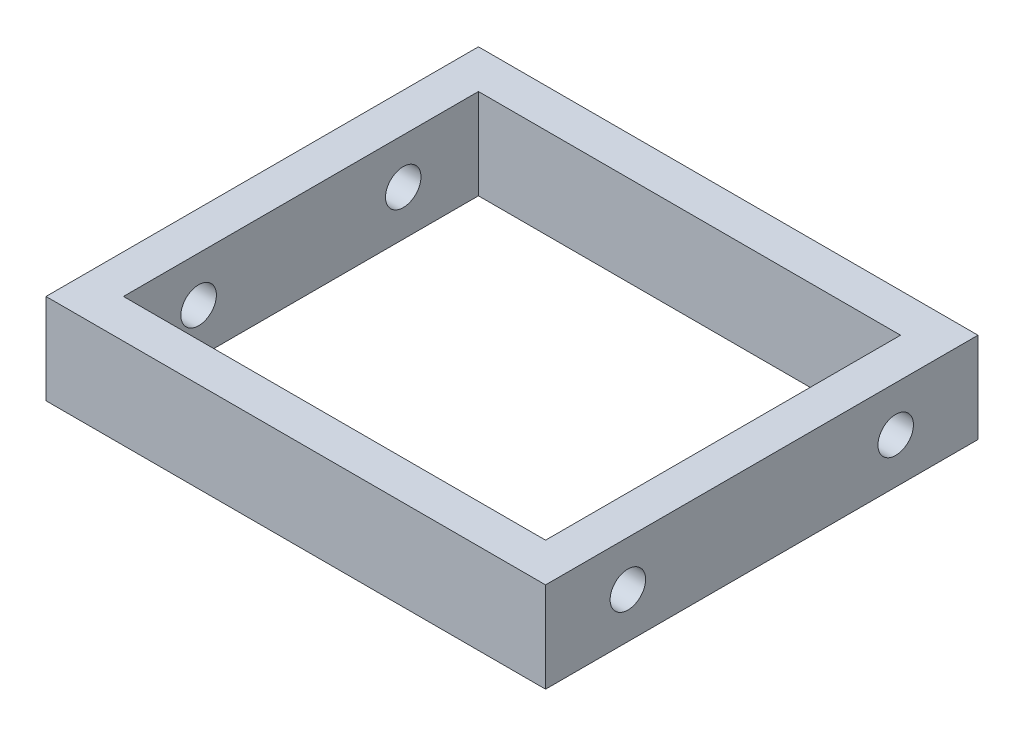
ISO-10303-21;
HEADER;
FILE_DESCRIPTION(('STEP AP214'),'2;1');
FILE_NAME('part.step','',(''),(''),'','','');
FILE_SCHEMA(('AUTOMOTIVE_DESIGN { 1 0 10303 214 1 1 1 1 }'));
ENDSEC;
DATA;
#1=APPLICATION_CONTEXT('core data for automotive mechanical design processes');
#2=APPLICATION_PROTOCOL_DEFINITION('international standard','automotive_design',2000,#1);
#3=PRODUCT_CONTEXT('',#1,'mechanical');
#4=PRODUCT('Part','Part','',(#3));
#5=PRODUCT_RELATED_PRODUCT_CATEGORY('part','',(#4));
#6=PRODUCT_DEFINITION_FORMATION('','',#4);
#7=PRODUCT_DEFINITION_CONTEXT('part definition',#1,'design');
#8=PRODUCT_DEFINITION('design','',#6,#7);
#9=PRODUCT_DEFINITION_SHAPE('','',#8);
#10=(LENGTH_UNIT() NAMED_UNIT(*) SI_UNIT(.MILLI.,.METRE.));
#11=(NAMED_UNIT(*) PLANE_ANGLE_UNIT() SI_UNIT($,.RADIAN.));
#12=(NAMED_UNIT(*) SI_UNIT($,.STERADIAN.) SOLID_ANGLE_UNIT());
#13=UNCERTAINTY_MEASURE_WITH_UNIT(LENGTH_MEASURE(1.E-05),#10,'distance_accuracy_value','');
#14=(GEOMETRIC_REPRESENTATION_CONTEXT(3) GLOBAL_UNCERTAINTY_ASSIGNED_CONTEXT((#13)) GLOBAL_UNIT_ASSIGNED_CONTEXT((#10,
#11,#12)) REPRESENTATION_CONTEXT('',''));
#15=CARTESIAN_POINT('',(0.,0.,0.));
#16=DIRECTION('',(0.,0.,1.));
#17=DIRECTION('',(1.,0.,0.));
#18=AXIS2_PLACEMENT_3D('',#15,#16,#17);
#19=CARTESIAN_POINT('',(0.,14.,33.5));
#20=DIRECTION('',(0.,0.,-1.));
#21=DIRECTION('',(-1.,0.,0.));
#22=AXIS2_PLACEMENT_3D('',#19,#20,#21);
#23=PLANE('',#22);
#24=DIRECTION('',(1.,0.,0.));
#25=VECTOR('',#24,1.);
#26=CARTESIAN_POINT('',(0.,0.,33.5));
#27=LINE('',#26,#25);
#28=CARTESIAN_POINT('',(-38.7,0.,33.5));
#29=VERTEX_POINT('',#28);
#30=CARTESIAN_POINT('',(38.7,0.,33.5));
#31=VERTEX_POINT('',#30);
#32=EDGE_CURVE('E143',#29,#31,#27,.T.);
#33=ORIENTED_EDGE('',*,*,#32,.T.);
#34=DIRECTION('',(0.,-1.,0.));
#35=VECTOR('',#34,1.);
#36=CARTESIAN_POINT('',(38.7,14.,33.5));
#37=LINE('',#36,#35);
#38=CARTESIAN_POINT('',(38.7,14.,33.5));
#39=VERTEX_POINT('',#38);
#40=EDGE_CURVE('E11',#39,#31,#37,.T.);
#41=ORIENTED_EDGE('',*,*,#40,.F.);
#42=DIRECTION('',(1.,0.,0.));
#43=VECTOR('',#42,1.);
#44=CARTESIAN_POINT('',(0.,14.,33.5));
#45=LINE('',#44,#43);
#46=CARTESIAN_POINT('',(-38.7,14.,33.5));
#47=VERTEX_POINT('',#46);
#48=EDGE_CURVE('E114',#47,#39,#45,.T.);
#49=ORIENTED_EDGE('',*,*,#48,.F.);
#50=DIRECTION('',(0.,-1.,0.));
#51=VECTOR('',#50,1.);
#52=CARTESIAN_POINT('',(-38.7,14.,33.5));
#53=LINE('',#52,#51);
#54=EDGE_CURVE('E54',#47,#29,#53,.T.);
#55=ORIENTED_EDGE('',*,*,#54,.T.);
#56=EDGE_LOOP('',(#33,#41,#49,#55));
#57=FACE_BOUND('',#56,.T.);
#58=ADVANCED_FACE('F35',(#57),#23,.F.);
#59=CARTESIAN_POINT('',(38.7,14.,0.));
#60=DIRECTION('',(-1.,0.,0.));
#61=DIRECTION('',(0.,0.,1.));
#62=AXIS2_PLACEMENT_3D('',#59,#60,#61);
#63=PLANE('',#62);
#64=CARTESIAN_POINT('',(38.7,7.,20.75));
#65=DIRECTION('',(1.,0.,0.));
#66=DIRECTION('',(0.,0.,-1.));
#67=AXIS2_PLACEMENT_3D('',#64,#65,#66);
#68=CIRCLE('',#67,2.75);
#69=CARTESIAN_POINT('',(38.7,7.,18.));
#70=VERTEX_POINT('',#69);
#71=EDGE_CURVE('E188',#70,#70,#68,.T.);
#72=ORIENTED_EDGE('',*,*,#71,.F.);
#73=EDGE_LOOP('',(#72));
#74=FACE_BOUND('',#73,.T.);
#75=CARTESIAN_POINT('',(38.7,7.,-20.75));
#76=DIRECTION('',(1.,0.,0.));
#77=DIRECTION('',(0.,0.,-1.));
#78=AXIS2_PLACEMENT_3D('',#75,#76,#77);
#79=CIRCLE('',#78,2.75);
#80=CARTESIAN_POINT('',(38.7,7.,-23.5));
#81=VERTEX_POINT('',#80);
#82=EDGE_CURVE('E189',#81,#81,#79,.T.);
#83=ORIENTED_EDGE('',*,*,#82,.F.);
#84=EDGE_LOOP('',(#83));
#85=FACE_BOUND('',#84,.T.);
#86=DIRECTION('',(0.,0.,-1.));
#87=VECTOR('',#86,1.);
#88=CARTESIAN_POINT('',(38.7,0.,0.));
#89=LINE('',#88,#87);
#90=CARTESIAN_POINT('',(38.7,0.,-33.5));
#91=VERTEX_POINT('',#90);
#92=EDGE_CURVE('E120',#31,#91,#89,.T.);
#93=ORIENTED_EDGE('',*,*,#92,.T.);
#94=DIRECTION('',(0.,-1.,0.));
#95=VECTOR('',#94,1.);
#96=CARTESIAN_POINT('',(38.7,14.,-33.5));
#97=LINE('',#96,#95);
#98=CARTESIAN_POINT('',(38.7,14.,-33.5));
#99=VERTEX_POINT('',#98);
#100=EDGE_CURVE('E45',#99,#91,#97,.T.);
#101=ORIENTED_EDGE('',*,*,#100,.F.);
#102=DIRECTION('',(0.,0.,-1.));
#103=VECTOR('',#102,1.);
#104=CARTESIAN_POINT('',(38.7,14.,0.));
#105=LINE('',#104,#103);
#106=EDGE_CURVE('E108',#39,#99,#105,.T.);
#107=ORIENTED_EDGE('',*,*,#106,.F.);
#108=ORIENTED_EDGE('',*,*,#40,.T.);
#109=EDGE_LOOP('',(#93,#101,#107,#108));
#110=FACE_BOUND('',#109,.T.);
#111=ADVANCED_FACE('F119',(#74,#85,#110),#63,.F.);
#112=CARTESIAN_POINT('',(0.,14.,-33.5));
#113=DIRECTION('',(0.,0.,-1.));
#114=DIRECTION('',(-1.,0.,0.));
#115=AXIS2_PLACEMENT_3D('',#112,#113,#114);
#116=PLANE('',#115);
#117=DIRECTION('',(1.,0.,0.));
#118=VECTOR('',#117,1.);
#119=CARTESIAN_POINT('',(0.,0.,-33.5));
#120=LINE('',#119,#118);
#121=CARTESIAN_POINT('',(-38.7,0.,-33.5));
#122=VERTEX_POINT('',#121);
#123=EDGE_CURVE('E146',#122,#91,#120,.T.);
#124=ORIENTED_EDGE('',*,*,#123,.F.);
#125=DIRECTION('',(0.,-1.,0.));
#126=VECTOR('',#125,1.);
#127=CARTESIAN_POINT('',(-38.7,14.,-33.5));
#128=LINE('',#127,#126);
#129=CARTESIAN_POINT('',(-38.7,14.,-33.5));
#130=VERTEX_POINT('',#129);
#131=EDGE_CURVE('E80',#130,#122,#128,.T.);
#132=ORIENTED_EDGE('',*,*,#131,.F.);
#133=DIRECTION('',(1.,0.,0.));
#134=VECTOR('',#133,1.);
#135=CARTESIAN_POINT('',(0.,14.,-33.5));
#136=LINE('',#135,#134);
#137=EDGE_CURVE('E113',#130,#99,#136,.T.);
#138=ORIENTED_EDGE('',*,*,#137,.T.);
#139=ORIENTED_EDGE('',*,*,#100,.T.);
#140=EDGE_LOOP('',(#124,#132,#138,#139));
#141=FACE_BOUND('',#140,.T.);
#142=ADVANCED_FACE('F124',(#141),#116,.T.);
#143=CARTESIAN_POINT('',(32.7,14.,0.));
#144=DIRECTION('',(-1.,0.,0.));
#145=DIRECTION('',(0.,0.,1.));
#146=AXIS2_PLACEMENT_3D('',#143,#144,#145);
#147=PLANE('',#146);
#148=CARTESIAN_POINT('',(32.7,7.,20.75));
#149=DIRECTION('',(-1.,0.,0.));
#150=DIRECTION('',(0.,0.,1.));
#151=AXIS2_PLACEMENT_3D('',#148,#149,#150);
#152=CIRCLE('',#151,2.75);
#153=CARTESIAN_POINT('',(32.7,7.,23.5));
#154=VERTEX_POINT('',#153);
#155=EDGE_CURVE('E135',#154,#154,#152,.F.);
#156=ORIENTED_EDGE('',*,*,#155,.T.);
#157=EDGE_LOOP('',(#156));
#158=FACE_BOUND('',#157,.T.);
#159=CARTESIAN_POINT('',(32.7,7.,-20.75));
#160=DIRECTION('',(-1.,0.,0.));
#161=DIRECTION('',(0.,0.,1.));
#162=AXIS2_PLACEMENT_3D('',#159,#160,#161);
#163=CIRCLE('',#162,2.75);
#164=CARTESIAN_POINT('',(32.7,7.,-18.));
#165=VERTEX_POINT('',#164);
#166=EDGE_CURVE('E185',#165,#165,#163,.F.);
#167=ORIENTED_EDGE('',*,*,#166,.T.);
#168=EDGE_LOOP('',(#167));
#169=FACE_BOUND('',#168,.T.);
#170=DIRECTION('',(0.,0.,-1.));
#171=VECTOR('',#170,1.);
#172=CARTESIAN_POINT('',(32.7,0.,0.));
#173=LINE('',#172,#171);
#174=CARTESIAN_POINT('',(32.7,0.,27.5));
#175=VERTEX_POINT('',#174);
#176=CARTESIAN_POINT('',(32.7,0.,-27.5));
#177=VERTEX_POINT('',#176);
#178=EDGE_CURVE('E131',#175,#177,#173,.T.);
#179=ORIENTED_EDGE('',*,*,#178,.F.);
#180=DIRECTION('',(0.,-1.,0.));
#181=VECTOR('',#180,1.);
#182=CARTESIAN_POINT('',(32.7,14.,27.5));
#183=LINE('',#182,#181);
#184=CARTESIAN_POINT('',(32.7,14.,27.5));
#185=VERTEX_POINT('',#184);
#186=EDGE_CURVE('E39',#185,#175,#183,.T.);
#187=ORIENTED_EDGE('',*,*,#186,.F.);
#188=DIRECTION('',(0.,0.,-1.));
#189=VECTOR('',#188,1.);
#190=CARTESIAN_POINT('',(32.7,14.,0.));
#191=LINE('',#190,#189);
#192=CARTESIAN_POINT('',(32.7,14.,-27.5));
#193=VERTEX_POINT('',#192);
#194=EDGE_CURVE('E151',#185,#193,#191,.T.);
#195=ORIENTED_EDGE('',*,*,#194,.T.);
#196=DIRECTION('',(0.,-1.,0.));
#197=VECTOR('',#196,1.);
#198=CARTESIAN_POINT('',(32.7,14.,-27.5));
#199=LINE('',#198,#197);
#200=EDGE_CURVE('E127',#193,#177,#199,.T.);
#201=ORIENTED_EDGE('',*,*,#200,.T.);
#202=EDGE_LOOP('',(#179,#187,#195,#201));
#203=FACE_BOUND('',#202,.T.);
#204=ADVANCED_FACE('F37',(#158,#169,#203),#147,.T.);
#205=CARTESIAN_POINT('',(0.,14.,27.5));
#206=DIRECTION('',(0.,0.,-1.));
#207=DIRECTION('',(-1.,0.,0.));
#208=AXIS2_PLACEMENT_3D('',#205,#206,#207);
#209=PLANE('',#208);
#210=DIRECTION('',(1.,0.,0.));
#211=VECTOR('',#210,1.);
#212=CARTESIAN_POINT('',(0.,0.,27.5));
#213=LINE('',#212,#211);
#214=CARTESIAN_POINT('',(-32.7,0.,27.5));
#215=VERTEX_POINT('',#214);
#216=EDGE_CURVE('E134',#215,#175,#213,.T.);
#217=ORIENTED_EDGE('',*,*,#216,.F.);
#218=DIRECTION('',(0.,-1.,0.));
#219=VECTOR('',#218,1.);
#220=CARTESIAN_POINT('',(-32.7,14.,27.5));
#221=LINE('',#220,#219);
#222=CARTESIAN_POINT('',(-32.7,14.,27.5));
#223=VERTEX_POINT('',#222);
#224=EDGE_CURVE('E157',#223,#215,#221,.T.);
#225=ORIENTED_EDGE('',*,*,#224,.F.);
#226=DIRECTION('',(1.,0.,0.));
#227=VECTOR('',#226,1.);
#228=CARTESIAN_POINT('',(0.,14.,27.5));
#229=LINE('',#228,#227);
#230=EDGE_CURVE('E166',#223,#185,#229,.T.);
#231=ORIENTED_EDGE('',*,*,#230,.T.);
#232=ORIENTED_EDGE('',*,*,#186,.T.);
#233=EDGE_LOOP('',(#217,#225,#231,#232));
#234=FACE_BOUND('',#233,.T.);
#235=ADVANCED_FACE('F164',(#234),#209,.T.);
#236=CARTESIAN_POINT('',(-32.7,14.,0.));
#237=DIRECTION('',(-1.,0.,0.));
#238=DIRECTION('',(0.,0.,1.));
#239=AXIS2_PLACEMENT_3D('',#236,#237,#238);
#240=PLANE('',#239);
#241=CARTESIAN_POINT('',(-32.7,7.,-15.85));
#242=DIRECTION('',(1.,0.,0.));
#243=DIRECTION('',(0.,0.,-1.));
#244=AXIS2_PLACEMENT_3D('',#241,#242,#243);
#245=CIRCLE('',#244,2.75);
#246=CARTESIAN_POINT('',(-32.7,7.,-18.6));
#247=VERTEX_POINT('',#246);
#248=EDGE_CURVE('E200',#247,#247,#245,.T.);
#249=ORIENTED_EDGE('',*,*,#248,.F.);
#250=EDGE_LOOP('',(#249));
#251=FACE_BOUND('',#250,.T.);
#252=CARTESIAN_POINT('',(-32.7,7.,15.85));
#253=DIRECTION('',(1.,0.,0.));
#254=DIRECTION('',(0.,0.,-1.));
#255=AXIS2_PLACEMENT_3D('',#252,#253,#254);
#256=CIRCLE('',#255,2.75);
#257=CARTESIAN_POINT('',(-32.7,7.,13.1));
#258=VERTEX_POINT('',#257);
#259=EDGE_CURVE('E201',#258,#258,#256,.T.);
#260=ORIENTED_EDGE('',*,*,#259,.F.);
#261=EDGE_LOOP('',(#260));
#262=FACE_BOUND('',#261,.T.);
#263=DIRECTION('',(0.,0.,-1.));
#264=VECTOR('',#263,1.);
#265=CARTESIAN_POINT('',(-32.7,0.,0.));
#266=LINE('',#265,#264);
#267=CARTESIAN_POINT('',(-32.7,0.,-27.5));
#268=VERTEX_POINT('',#267);
#269=EDGE_CURVE('E138',#215,#268,#266,.T.);
#270=ORIENTED_EDGE('',*,*,#269,.T.);
#271=DIRECTION('',(0.,-1.,0.));
#272=VECTOR('',#271,1.);
#273=CARTESIAN_POINT('',(-32.7,14.,-27.5));
#274=LINE('',#273,#272);
#275=CARTESIAN_POINT('',(-32.7,14.,-27.5));
#276=VERTEX_POINT('',#275);
#277=EDGE_CURVE('E155',#276,#268,#274,.T.);
#278=ORIENTED_EDGE('',*,*,#277,.F.);
#279=DIRECTION('',(0.,0.,-1.));
#280=VECTOR('',#279,1.);
#281=CARTESIAN_POINT('',(-32.7,14.,0.));
#282=LINE('',#281,#280);
#283=EDGE_CURVE('E179',#223,#276,#282,.T.);
#284=ORIENTED_EDGE('',*,*,#283,.F.);
#285=ORIENTED_EDGE('',*,*,#224,.T.);
#286=EDGE_LOOP('',(#270,#278,#284,#285));
#287=FACE_BOUND('',#286,.T.);
#288=ADVANCED_FACE('F173',(#251,#262,#287),#240,.F.);
#289=CARTESIAN_POINT('',(0.,14.,-27.5));
#290=DIRECTION('',(0.,0.,-1.));
#291=DIRECTION('',(-1.,0.,0.));
#292=AXIS2_PLACEMENT_3D('',#289,#290,#291);
#293=PLANE('',#292);
#294=DIRECTION('',(1.,0.,0.));
#295=VECTOR('',#294,1.);
#296=CARTESIAN_POINT('',(0.,0.,-27.5));
#297=LINE('',#296,#295);
#298=EDGE_CURVE('E140',#268,#177,#297,.T.);
#299=ORIENTED_EDGE('',*,*,#298,.T.);
#300=ORIENTED_EDGE('',*,*,#200,.F.);
#301=DIRECTION('',(1.,0.,0.));
#302=VECTOR('',#301,1.);
#303=CARTESIAN_POINT('',(0.,14.,-27.5));
#304=LINE('',#303,#302);
#305=EDGE_CURVE('E177',#276,#193,#304,.T.);
#306=ORIENTED_EDGE('',*,*,#305,.F.);
#307=ORIENTED_EDGE('',*,*,#277,.T.);
#308=EDGE_LOOP('',(#299,#300,#306,#307));
#309=FACE_BOUND('',#308,.T.);
#310=ADVANCED_FACE('F176',(#309),#293,.F.);
#311=CARTESIAN_POINT('',(-38.7,14.,0.));
#312=DIRECTION('',(-1.,0.,0.));
#313=DIRECTION('',(0.,0.,1.));
#314=AXIS2_PLACEMENT_3D('',#311,#312,#313);
#315=PLANE('',#314);
#316=CARTESIAN_POINT('',(-38.7,7.,-15.85));
#317=DIRECTION('',(-1.,0.,0.));
#318=DIRECTION('',(0.,0.,1.));
#319=AXIS2_PLACEMENT_3D('',#316,#317,#318);
#320=CIRCLE('',#319,2.75);
#321=CARTESIAN_POINT('',(-38.7,7.,-13.1));
#322=VERTEX_POINT('',#321);
#323=EDGE_CURVE('E192',#322,#322,#320,.F.);
#324=ORIENTED_EDGE('',*,*,#323,.T.);
#325=EDGE_LOOP('',(#324));
#326=FACE_BOUND('',#325,.T.);
#327=CARTESIAN_POINT('',(-38.7,7.,15.85));
#328=DIRECTION('',(-1.,0.,0.));
#329=DIRECTION('',(0.,0.,1.));
#330=AXIS2_PLACEMENT_3D('',#327,#328,#329);
#331=CIRCLE('',#330,2.75);
#332=CARTESIAN_POINT('',(-38.7,7.,18.6));
#333=VERTEX_POINT('',#332);
#334=EDGE_CURVE('E197',#333,#333,#331,.F.);
#335=ORIENTED_EDGE('',*,*,#334,.T.);
#336=EDGE_LOOP('',(#335));
#337=FACE_BOUND('',#336,.T.);
#338=DIRECTION('',(0.,0.,-1.));
#339=VECTOR('',#338,1.);
#340=CARTESIAN_POINT('',(-38.7,0.,0.));
#341=LINE('',#340,#339);
#342=EDGE_CURVE('E148',#29,#122,#341,.T.);
#343=ORIENTED_EDGE('',*,*,#342,.F.);
#344=ORIENTED_EDGE('',*,*,#54,.F.);
#345=DIRECTION('',(0.,0.,-1.));
#346=VECTOR('',#345,1.);
#347=CARTESIAN_POINT('',(-38.7,14.,0.));
#348=LINE('',#347,#346);
#349=EDGE_CURVE('E125',#47,#130,#348,.T.);
#350=ORIENTED_EDGE('',*,*,#349,.T.);
#351=ORIENTED_EDGE('',*,*,#131,.T.);
#352=EDGE_LOOP('',(#343,#344,#350,#351));
#353=FACE_BOUND('',#352,.T.);
#354=ADVANCED_FACE('F224',(#326,#337,#353),#315,.T.);
#355=CARTESIAN_POINT('',(0.,14.,0.));
#356=DIRECTION('',(0.,1.,0.));
#357=DIRECTION('',(0.,0.,1.));
#358=AXIS2_PLACEMENT_3D('',#355,#356,#357);
#359=PLANE('',#358);
#360=ORIENTED_EDGE('',*,*,#194,.F.);
#361=ORIENTED_EDGE('',*,*,#230,.F.);
#362=ORIENTED_EDGE('',*,*,#283,.T.);
#363=ORIENTED_EDGE('',*,*,#305,.T.);
#364=EDGE_LOOP('',(#360,#361,#362,#363));
#365=FACE_BOUND('',#364,.T.);
#366=ORIENTED_EDGE('',*,*,#48,.T.);
#367=ORIENTED_EDGE('',*,*,#106,.T.);
#368=ORIENTED_EDGE('',*,*,#137,.F.);
#369=ORIENTED_EDGE('',*,*,#349,.F.);
#370=EDGE_LOOP('',(#366,#367,#368,#369));
#371=FACE_BOUND('',#370,.T.);
#372=ADVANCED_FACE('F110',(#365,#371),#359,.T.);
#373=CARTESIAN_POINT('',(0.,0.,0.));
#374=DIRECTION('',(0.,1.,0.));
#375=DIRECTION('',(0.,0.,1.));
#376=AXIS2_PLACEMENT_3D('',#373,#374,#375);
#377=PLANE('',#376);
#378=ORIENTED_EDGE('',*,*,#178,.T.);
#379=ORIENTED_EDGE('',*,*,#298,.F.);
#380=ORIENTED_EDGE('',*,*,#269,.F.);
#381=ORIENTED_EDGE('',*,*,#216,.T.);
#382=EDGE_LOOP('',(#378,#379,#380,#381));
#383=FACE_BOUND('',#382,.T.);
#384=ORIENTED_EDGE('',*,*,#32,.F.);
#385=ORIENTED_EDGE('',*,*,#342,.T.);
#386=ORIENTED_EDGE('',*,*,#123,.T.);
#387=ORIENTED_EDGE('',*,*,#92,.F.);
#388=EDGE_LOOP('',(#384,#385,#386,#387));
#389=FACE_BOUND('',#388,.T.);
#390=ADVANCED_FACE('F170',(#383,#389),#377,.F.);
#391=CARTESIAN_POINT('',(24.921825406948,7.,-20.75));
#392=DIRECTION('',(1.,0.,0.));
#393=DIRECTION('',(0.,0.,-1.));
#394=AXIS2_PLACEMENT_3D('',#391,#392,#393);
#395=CYLINDRICAL_SURFACE('',#394,2.75);
#396=ORIENTED_EDGE('',*,*,#82,.T.);
#397=EDGE_LOOP('',(#396));
#398=FACE_BOUND('',#397,.T.);
#399=ORIENTED_EDGE('',*,*,#166,.F.);
#400=EDGE_LOOP('',(#399));
#401=FACE_BOUND('',#400,.T.);
#402=ADVANCED_FACE('F250',(#398,#401),#395,.F.);
#403=CARTESIAN_POINT('',(24.921825406948,7.,20.75));
#404=DIRECTION('',(1.,0.,0.));
#405=DIRECTION('',(0.,0.,-1.));
#406=AXIS2_PLACEMENT_3D('',#403,#404,#405);
#407=CYLINDRICAL_SURFACE('',#406,2.75);
#408=ORIENTED_EDGE('',*,*,#71,.T.);
#409=EDGE_LOOP('',(#408));
#410=FACE_BOUND('',#409,.T.);
#411=ORIENTED_EDGE('',*,*,#155,.F.);
#412=EDGE_LOOP('',(#411));
#413=FACE_BOUND('',#412,.T.);
#414=ADVANCED_FACE('F220',(#410,#413),#407,.F.);
#415=CARTESIAN_POINT('',(-46.478174593052,7.,15.85));
#416=DIRECTION('',(1.,0.,0.));
#417=DIRECTION('',(0.,0.,-1.));
#418=AXIS2_PLACEMENT_3D('',#415,#416,#417);
#419=CYLINDRICAL_SURFACE('',#418,2.75);
#420=ORIENTED_EDGE('',*,*,#259,.T.);
#421=EDGE_LOOP('',(#420));
#422=FACE_BOUND('',#421,.T.);
#423=ORIENTED_EDGE('',*,*,#334,.F.);
#424=EDGE_LOOP('',(#423));
#425=FACE_BOUND('',#424,.T.);
#426=ADVANCED_FACE('F217',(#422,#425),#419,.F.);
#427=CARTESIAN_POINT('',(-46.478174593052,7.,-15.85));
#428=DIRECTION('',(1.,0.,0.));
#429=DIRECTION('',(0.,0.,-1.));
#430=AXIS2_PLACEMENT_3D('',#427,#428,#429);
#431=CYLINDRICAL_SURFACE('',#430,2.75);
#432=ORIENTED_EDGE('',*,*,#248,.T.);
#433=EDGE_LOOP('',(#432));
#434=FACE_BOUND('',#433,.T.);
#435=ORIENTED_EDGE('',*,*,#323,.F.);
#436=EDGE_LOOP('',(#435));
#437=FACE_BOUND('',#436,.T.);
#438=ADVANCED_FACE('F209',(#434,#437),#431,.F.);
#439=CLOSED_SHELL('',(#58,#111,#142,#204,#235,#288,#310,#354,#372,#390,#402,#414,#426,#438));
#440=MANIFOLD_SOLID_BREP('B2',#439);
#441=ADVANCED_BREP_SHAPE_REPRESENTATION('',(#18,#440),#14);
#442=SHAPE_DEFINITION_REPRESENTATION(#9,#441);
ENDSEC;
END-ISO-10303-21;
